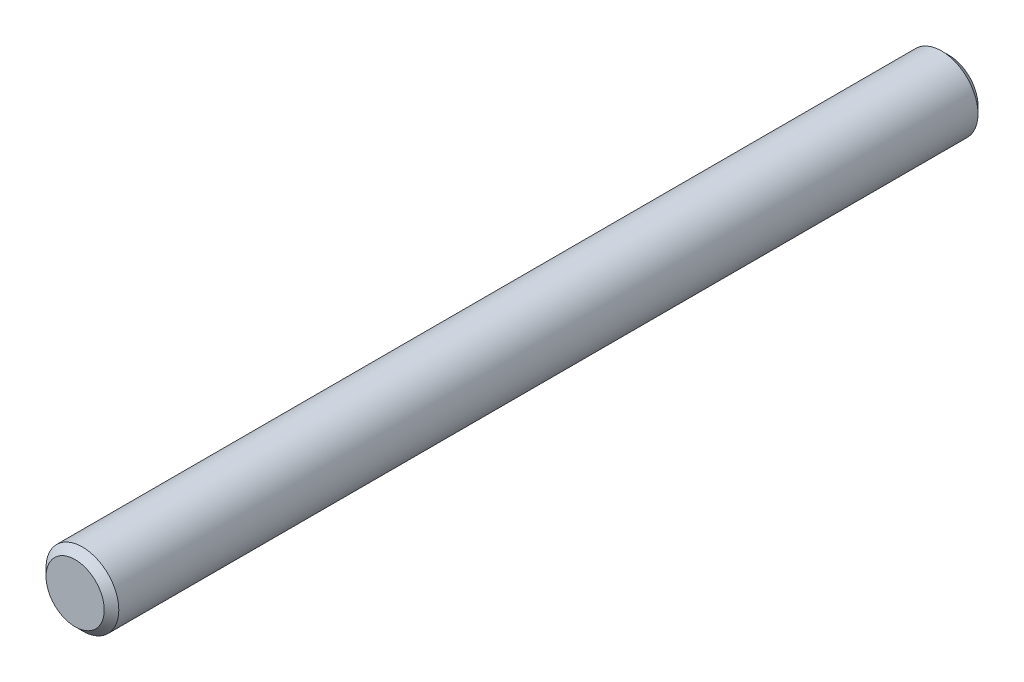
ISO-10303-21;
HEADER;
FILE_DESCRIPTION(('STEP AP214'),'2;1');
FILE_NAME('part.step','',(''),(''),'','','');
FILE_SCHEMA(('AUTOMOTIVE_DESIGN { 1 0 10303 214 1 1 1 1 }'));
ENDSEC;
DATA;
#1=APPLICATION_CONTEXT('core data for automotive mechanical design processes');
#2=APPLICATION_PROTOCOL_DEFINITION('international standard','automotive_design',2000,#1);
#3=PRODUCT_CONTEXT('',#1,'mechanical');
#4=PRODUCT('Part','Part','',(#3));
#5=PRODUCT_RELATED_PRODUCT_CATEGORY('part','',(#4));
#6=PRODUCT_DEFINITION_FORMATION('','',#4);
#7=PRODUCT_DEFINITION_CONTEXT('part definition',#1,'design');
#8=PRODUCT_DEFINITION('design','',#6,#7);
#9=PRODUCT_DEFINITION_SHAPE('','',#8);
#10=(LENGTH_UNIT() NAMED_UNIT(*) SI_UNIT(.MILLI.,.METRE.));
#11=(NAMED_UNIT(*) PLANE_ANGLE_UNIT() SI_UNIT($,.RADIAN.));
#12=(NAMED_UNIT(*) SI_UNIT($,.STERADIAN.) SOLID_ANGLE_UNIT());
#13=UNCERTAINTY_MEASURE_WITH_UNIT(LENGTH_MEASURE(1.E-05),#10,'distance_accuracy_value','');
#14=(GEOMETRIC_REPRESENTATION_CONTEXT(3) GLOBAL_UNCERTAINTY_ASSIGNED_CONTEXT((#13)) GLOBAL_UNIT_ASSIGNED_CONTEXT((#10,
#11,#12)) REPRESENTATION_CONTEXT('',''));
#15=CARTESIAN_POINT('',(0.,0.,0.));
#16=DIRECTION('',(0.,0.,1.));
#17=DIRECTION('',(1.,0.,0.));
#18=AXIS2_PLACEMENT_3D('',#15,#16,#17);
#19=CARTESIAN_POINT('',(0.,0.,60.));
#20=DIRECTION('',(0.,0.,-1.));
#21=DIRECTION('',(-1.,0.,0.));
#22=AXIS2_PLACEMENT_3D('',#19,#20,#21);
#23=CYLINDRICAL_SURFACE('',#22,2.5);
#24=CARTESIAN_POINT('',(0.,0.,0.5));
#25=DIRECTION('',(0.,0.,1.));
#26=DIRECTION('',(1.,0.,0.));
#27=AXIS2_PLACEMENT_3D('',#24,#25,#26);
#28=CIRCLE('',#27,2.5);
#29=CARTESIAN_POINT('',(2.5,0.,0.5));
#30=VERTEX_POINT('',#29);
#31=EDGE_CURVE('E41',#30,#30,#28,.T.);
#32=ORIENTED_EDGE('',*,*,#31,.T.);
#33=EDGE_LOOP('',(#32));
#34=FACE_BOUND('',#33,.T.);
#35=CARTESIAN_POINT('',(0.,0.,59.5));
#36=DIRECTION('',(0.,0.,1.));
#37=DIRECTION('',(1.,0.,0.));
#38=AXIS2_PLACEMENT_3D('',#35,#36,#37);
#39=CIRCLE('',#38,2.5);
#40=CARTESIAN_POINT('',(2.5,0.,59.5));
#41=VERTEX_POINT('',#40);
#42=EDGE_CURVE('E45',#41,#41,#39,.F.);
#43=ORIENTED_EDGE('',*,*,#42,.T.);
#44=EDGE_LOOP('',(#43));
#45=FACE_BOUND('',#44,.T.);
#46=ADVANCED_FACE('F30',(#34,#45),#23,.T.);
#47=CARTESIAN_POINT('',(0.,0.,60.));
#48=DIRECTION('',(0.,0.,1.));
#49=DIRECTION('',(1.,0.,0.));
#50=AXIS2_PLACEMENT_3D('',#47,#48,#49);
#51=PLANE('',#50);
#52=CARTESIAN_POINT('',(0.,0.,60.));
#53=DIRECTION('',(0.,0.,1.));
#54=DIRECTION('',(1.,0.,0.));
#55=AXIS2_PLACEMENT_3D('',#52,#53,#54);
#56=CIRCLE('',#55,2.);
#57=CARTESIAN_POINT('',(2.,0.,60.));
#58=VERTEX_POINT('',#57);
#59=EDGE_CURVE('E10',#58,#58,#56,.T.);
#60=ORIENTED_EDGE('',*,*,#59,.T.);
#61=EDGE_LOOP('',(#60));
#62=FACE_BOUND('',#61,.T.);
#63=ADVANCED_FACE('F61',(#62),#51,.T.);
#64=CARTESIAN_POINT('',(0.,0.,0.));
#65=DIRECTION('',(0.,0.,1.));
#66=DIRECTION('',(1.,0.,0.));
#67=AXIS2_PLACEMENT_3D('',#64,#65,#66);
#68=PLANE('',#67);
#69=CARTESIAN_POINT('',(0.,0.,0.));
#70=DIRECTION('',(0.,0.,1.));
#71=DIRECTION('',(1.,0.,0.));
#72=AXIS2_PLACEMENT_3D('',#69,#70,#71);
#73=CIRCLE('',#72,1.99999999999999);
#74=CARTESIAN_POINT('',(1.99999999999999,0.,0.));
#75=VERTEX_POINT('',#74);
#76=EDGE_CURVE('E37',#75,#75,#73,.F.);
#77=ORIENTED_EDGE('',*,*,#76,.T.);
#78=EDGE_LOOP('',(#77));
#79=FACE_BOUND('',#78,.T.);
#80=ADVANCED_FACE('F58',(#79),#68,.F.);
#81=CARTESIAN_POINT('',(0.,0.,0.5));
#82=DIRECTION('',(0.,0.,1.));
#83=DIRECTION('',(1.,0.,0.));
#84=AXIS2_PLACEMENT_3D('',#81,#82,#83);
#85=CONICAL_SURFACE('',#84,2.5,0.785398163397453);
#86=ORIENTED_EDGE('',*,*,#76,.F.);
#87=EDGE_LOOP('',(#86));
#88=FACE_BOUND('',#87,.T.);
#89=ORIENTED_EDGE('',*,*,#31,.F.);
#90=EDGE_LOOP('',(#89));
#91=FACE_BOUND('',#90,.T.);
#92=ADVANCED_FACE('F54',(#88,#91),#85,.T.);
#93=CARTESIAN_POINT('',(0.,0.,60.));
#94=DIRECTION('',(0.,0.,-1.));
#95=DIRECTION('',(-1.,0.,0.));
#96=AXIS2_PLACEMENT_3D('',#93,#94,#95);
#97=CONICAL_SURFACE('',#96,2.,0.785398163397439);
#98=ORIENTED_EDGE('',*,*,#42,.F.);
#99=EDGE_LOOP('',(#98));
#100=FACE_BOUND('',#99,.T.);
#101=ORIENTED_EDGE('',*,*,#59,.F.);
#102=EDGE_LOOP('',(#101));
#103=FACE_BOUND('',#102,.T.);
#104=ADVANCED_FACE('F32',(#100,#103),#97,.T.);
#105=CLOSED_SHELL('',(#46,#63,#80,#92,#104));
#106=MANIFOLD_SOLID_BREP('B2',#105);
#107=ADVANCED_BREP_SHAPE_REPRESENTATION('',(#18,#106),#14);
#108=SHAPE_DEFINITION_REPRESENTATION(#9,#107);
ENDSEC;
END-ISO-10303-21;
